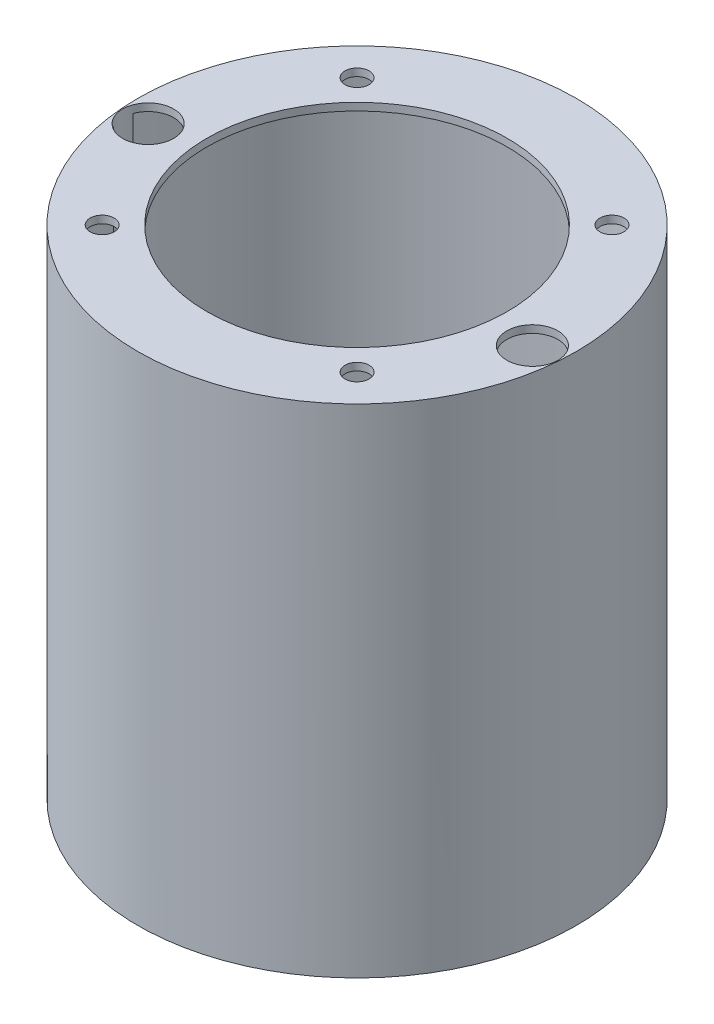
ISO-10303-21;
HEADER;
FILE_DESCRIPTION(('STEP AP214'),'2;1');
FILE_NAME('part.step','',(''),(''),'','','');
FILE_SCHEMA(('AUTOMOTIVE_DESIGN { 1 0 10303 214 1 1 1 1 }'));
ENDSEC;
DATA;
#1=APPLICATION_CONTEXT('core data for automotive mechanical design processes');
#2=APPLICATION_PROTOCOL_DEFINITION('international standard','automotive_design',2000,#1);
#3=PRODUCT_CONTEXT('',#1,'mechanical');
#4=PRODUCT('Part','Part','',(#3));
#5=PRODUCT_RELATED_PRODUCT_CATEGORY('part','',(#4));
#6=PRODUCT_DEFINITION_FORMATION('','',#4);
#7=PRODUCT_DEFINITION_CONTEXT('part definition',#1,'design');
#8=PRODUCT_DEFINITION('design','',#6,#7);
#9=PRODUCT_DEFINITION_SHAPE('','',#8);
#10=(LENGTH_UNIT() NAMED_UNIT(*) SI_UNIT(.MILLI.,.METRE.));
#11=(NAMED_UNIT(*) PLANE_ANGLE_UNIT() SI_UNIT($,.RADIAN.));
#12=(NAMED_UNIT(*) SI_UNIT($,.STERADIAN.) SOLID_ANGLE_UNIT());
#13=UNCERTAINTY_MEASURE_WITH_UNIT(LENGTH_MEASURE(1.E-05),#10,'distance_accuracy_value','');
#14=(GEOMETRIC_REPRESENTATION_CONTEXT(3) GLOBAL_UNCERTAINTY_ASSIGNED_CONTEXT((#13)) GLOBAL_UNIT_ASSIGNED_CONTEXT((#10,
#11,#12)) REPRESENTATION_CONTEXT('',''));
#15=CARTESIAN_POINT('',(0.,0.,0.));
#16=DIRECTION('',(0.,0.,1.));
#17=DIRECTION('',(1.,0.,0.));
#18=AXIS2_PLACEMENT_3D('',#15,#16,#17);
#19=CARTESIAN_POINT('',(0.,-207.01,0.));
#20=DIRECTION('',(0.,1.,0.));
#21=DIRECTION('',(0.,0.,1.));
#22=AXIS2_PLACEMENT_3D('',#19,#20,#21);
#23=CYLINDRICAL_SURFACE('',#22,91.44);
#24=CARTESIAN_POINT('',(0.,-207.01,0.));
#25=DIRECTION('',(0.,-1.,0.));
#26=DIRECTION('',(0.,0.,-1.));
#27=AXIS2_PLACEMENT_3D('',#24,#25,#26);
#28=CIRCLE('',#27,91.44);
#29=CARTESIAN_POINT('',(90.5837880600415,-207.01,12.4840274228105));
#30=VERTEX_POINT('',#29);
#31=CARTESIAN_POINT('',(-90.5837880600415,-207.01,12.4840274228104));
#32=VERTEX_POINT('',#31);
#33=EDGE_CURVE('E86',#30,#32,#28,.T.);
#34=ORIENTED_EDGE('',*,*,#33,.T.);
#35=DIRECTION('',(0.,1.,0.));
#36=VECTOR('',#35,1.);
#37=CARTESIAN_POINT('',(-90.5837880600414,-101.9175,12.4840274228105));
#38=LINE('',#37,#36);
#39=CARTESIAN_POINT('',(-90.5837880600415,0.,12.4840274228106));
#40=VERTEX_POINT('',#39);
#41=EDGE_CURVE('E11',#32,#40,#38,.T.);
#42=ORIENTED_EDGE('',*,*,#41,.T.);
#43=CARTESIAN_POINT('',(0.,0.,0.));
#44=DIRECTION('',(0.,-1.,0.));
#45=DIRECTION('',(0.,0.,-1.));
#46=AXIS2_PLACEMENT_3D('',#43,#44,#45);
#47=CIRCLE('',#46,91.44);
#48=CARTESIAN_POINT('',(90.5837880600415,0.,12.4840274228105));
#49=VERTEX_POINT('',#48);
#50=EDGE_CURVE('E96',#49,#40,#47,.T.);
#51=ORIENTED_EDGE('',*,*,#50,.F.);
#52=DIRECTION('',(0.,1.,0.));
#53=VECTOR('',#52,1.);
#54=CARTESIAN_POINT('',(90.5837880600414,-101.9175,12.4840274228105));
#55=LINE('',#54,#53);
#56=EDGE_CURVE('E90',#30,#49,#55,.T.);
#57=ORIENTED_EDGE('',*,*,#56,.F.);
#58=EDGE_LOOP('',(#34,#42,#51,#57));
#59=FACE_BOUND('',#58,.T.);
#60=ADVANCED_FACE('F35',(#59),#23,.F.);
#61=CARTESIAN_POINT('',(-91.3754453906586,0.,3.43534272799283));
#62=VERTEX_POINT('',#61);
#63=CARTESIAN_POINT('',(91.3754453906586,0.,3.43534272799283));
#64=VERTEX_POINT('',#63);
#65=EDGE_CURVE('E101',#62,#64,#47,.T.);
#66=ORIENTED_EDGE('',*,*,#65,.F.);
#67=DIRECTION('',(0.,1.,0.));
#68=VECTOR('',#67,1.);
#69=CARTESIAN_POINT('',(-91.3754453906585,-101.9175,3.43534272799285));
#70=LINE('',#69,#68);
#71=CARTESIAN_POINT('',(-91.3754453906586,-207.01,3.43534272799301));
#72=VERTEX_POINT('',#71);
#73=EDGE_CURVE('E43',#62,#72,#70,.F.);
#74=ORIENTED_EDGE('',*,*,#73,.T.);
#75=CARTESIAN_POINT('',(91.3754453906585,-207.01,3.43534272799287));
#76=VERTEX_POINT('',#75);
#77=EDGE_CURVE('E87',#72,#76,#28,.T.);
#78=ORIENTED_EDGE('',*,*,#77,.T.);
#79=DIRECTION('',(0.,1.,0.));
#80=VECTOR('',#79,1.);
#81=CARTESIAN_POINT('',(91.3754453906585,-101.9175,3.43534272799285));
#82=LINE('',#81,#80);
#83=EDGE_CURVE('E112',#64,#76,#82,.F.);
#84=ORIENTED_EDGE('',*,*,#83,.F.);
#85=EDGE_LOOP('',(#66,#74,#78,#84));
#86=FACE_BOUND('',#85,.T.);
#87=ADVANCED_FACE('F115',(#86),#23,.F.);
#88=CARTESIAN_POINT('',(0.,0.,0.));
#89=DIRECTION('',(0.,1.,0.));
#90=DIRECTION('',(0.,0.,1.));
#91=AXIS2_PLACEMENT_3D('',#88,#89,#90);
#92=PLANE('',#91);
#93=CARTESIAN_POINT('',(53.8815367264146,0.,-53.8815367264152));
#94=DIRECTION('',(0.,1.,0.));
#95=DIRECTION('',(0.,0.,1.));
#96=AXIS2_PLACEMENT_3D('',#93,#94,#95);
#97=CIRCLE('',#96,5.08000000000001);
#98=CARTESIAN_POINT('',(53.8815367264146,0.,-48.8015367264152));
#99=VERTEX_POINT('',#98);
#100=EDGE_CURVE('E262',#99,#99,#97,.F.);
#101=ORIENTED_EDGE('',*,*,#100,.F.);
#102=EDGE_LOOP('',(#101));
#103=FACE_BOUND('',#102,.T.);
#104=CARTESIAN_POINT('',(-53.8815367264152,0.,-53.8815367264146));
#105=DIRECTION('',(0.,1.,0.));
#106=DIRECTION('',(0.,0.,1.));
#107=AXIS2_PLACEMENT_3D('',#104,#105,#106);
#108=CIRCLE('',#107,5.08000000000001);
#109=CARTESIAN_POINT('',(-53.8815367264152,0.,-48.8015367264146));
#110=VERTEX_POINT('',#109);
#111=EDGE_CURVE('E270',#110,#110,#108,.F.);
#112=ORIENTED_EDGE('',*,*,#111,.F.);
#113=EDGE_LOOP('',(#112));
#114=FACE_BOUND('',#113,.T.);
#115=CARTESIAN_POINT('',(-53.8815367264146,0.,53.8815367264152));
#116=DIRECTION('',(0.,1.,0.));
#117=DIRECTION('',(0.,0.,1.));
#118=AXIS2_PLACEMENT_3D('',#115,#116,#117);
#119=CIRCLE('',#118,5.07999999999977);
#120=CARTESIAN_POINT('',(-53.8815367264146,0.,58.961536726415));
#121=VERTEX_POINT('',#120);
#122=EDGE_CURVE('E277',#121,#121,#119,.F.);
#123=ORIENTED_EDGE('',*,*,#122,.F.);
#124=EDGE_LOOP('',(#123));
#125=FACE_BOUND('',#124,.T.);
#126=CARTESIAN_POINT('',(53.8815367264152,0.,53.8815367264146));
#127=DIRECTION('',(0.,1.,0.));
#128=DIRECTION('',(0.,0.,1.));
#129=AXIS2_PLACEMENT_3D('',#126,#127,#128);
#130=CIRCLE('',#129,5.08000000000003);
#131=CARTESIAN_POINT('',(53.8815367264152,0.,58.9615367264147));
#132=VERTEX_POINT('',#131);
#133=EDGE_CURVE('E276',#132,#132,#130,.F.);
#134=ORIENTED_EDGE('',*,*,#133,.F.);
#135=EDGE_LOOP('',(#134));
#136=FACE_BOUND('',#135,.T.);
#137=CARTESIAN_POINT('',(-81.2237385142124,0.,7.10615632918758));
#138=DIRECTION('',(0.,1.,0.));
#139=DIRECTION('',(0.,0.,1.));
#140=AXIS2_PLACEMENT_3D('',#137,#138,#139);
#141=CIRCLE('',#140,10.795);
#142=EDGE_CURVE('E76',#62,#40,#141,.F.);
#143=ORIENTED_EDGE('',*,*,#142,.F.);
#144=ORIENTED_EDGE('',*,*,#65,.T.);
#145=CARTESIAN_POINT('',(81.2237385142124,0.,7.10615632918758));
#146=DIRECTION('',(0.,1.,0.));
#147=DIRECTION('',(0.,0.,1.));
#148=AXIS2_PLACEMENT_3D('',#145,#146,#147);
#149=CIRCLE('',#148,10.795);
#150=EDGE_CURVE('E99',#64,#49,#149,.T.);
#151=ORIENTED_EDGE('',*,*,#150,.T.);
#152=ORIENTED_EDGE('',*,*,#50,.T.);
#153=EDGE_LOOP('',(#143,#144,#151,#152));
#154=FACE_BOUND('',#153,.T.);
#155=CARTESIAN_POINT('',(0.,0.,0.));
#156=DIRECTION('',(0.,1.,0.));
#157=DIRECTION('',(0.,0.,1.));
#158=AXIS2_PLACEMENT_3D('',#155,#156,#157);
#159=CIRCLE('',#158,63.5);
#160=CARTESIAN_POINT('',(0.,0.,63.5));
#161=VERTEX_POINT('',#160);
#162=EDGE_CURVE('E94',#161,#161,#159,.T.);
#163=ORIENTED_EDGE('',*,*,#162,.T.);
#164=EDGE_LOOP('',(#163));
#165=FACE_BOUND('',#164,.T.);
#166=ADVANCED_FACE('F118',(#103,#114,#125,#136,#154,#165),#92,.F.);
#167=CARTESIAN_POINT('',(0.,3.175,0.));
#168=DIRECTION('',(0.,1.,0.));
#169=DIRECTION('',(0.,0.,1.));
#170=AXIS2_PLACEMENT_3D('',#167,#168,#169);
#171=PLANE('',#170);
#172=CARTESIAN_POINT('',(53.8815367264146,3.175,-53.8815367264152));
#173=DIRECTION('',(0.,1.,0.));
#174=DIRECTION('',(0.,0.,1.));
#175=AXIS2_PLACEMENT_3D('',#172,#173,#174);
#176=CIRCLE('',#175,5.08000000000001);
#177=CARTESIAN_POINT('',(53.8815367264146,3.175,-48.8015367264152));
#178=VERTEX_POINT('',#177);
#179=EDGE_CURVE('E265',#178,#178,#176,.T.);
#180=ORIENTED_EDGE('',*,*,#179,.F.);
#181=EDGE_LOOP('',(#180));
#182=FACE_BOUND('',#181,.T.);
#183=CARTESIAN_POINT('',(-53.8815367264152,3.175,-53.8815367264146));
#184=DIRECTION('',(0.,1.,0.));
#185=DIRECTION('',(0.,0.,1.));
#186=AXIS2_PLACEMENT_3D('',#183,#184,#185);
#187=CIRCLE('',#186,5.08000000000001);
#188=CARTESIAN_POINT('',(-53.8815367264152,3.175,-48.8015367264146));
#189=VERTEX_POINT('',#188);
#190=EDGE_CURVE('E267',#189,#189,#187,.T.);
#191=ORIENTED_EDGE('',*,*,#190,.F.);
#192=EDGE_LOOP('',(#191));
#193=FACE_BOUND('',#192,.T.);
#194=CARTESIAN_POINT('',(-53.8815367264146,3.175,53.8815367264152));
#195=DIRECTION('',(0.,1.,0.));
#196=DIRECTION('',(0.,0.,1.));
#197=AXIS2_PLACEMENT_3D('',#194,#195,#196);
#198=CIRCLE('',#197,5.07999999999977);
#199=CARTESIAN_POINT('',(-53.8815367264146,3.175,58.961536726415));
#200=VERTEX_POINT('',#199);
#201=EDGE_CURVE('E288',#200,#200,#198,.T.);
#202=ORIENTED_EDGE('',*,*,#201,.F.);
#203=EDGE_LOOP('',(#202));
#204=FACE_BOUND('',#203,.T.);
#205=CARTESIAN_POINT('',(53.8815367264152,3.175,53.8815367264146));
#206=DIRECTION('',(0.,1.,0.));
#207=DIRECTION('',(0.,0.,1.));
#208=AXIS2_PLACEMENT_3D('',#205,#206,#207);
#209=CIRCLE('',#208,5.08000000000003);
#210=CARTESIAN_POINT('',(53.8815367264152,3.175,58.9615367264147));
#211=VERTEX_POINT('',#210);
#212=EDGE_CURVE('E273',#211,#211,#209,.T.);
#213=ORIENTED_EDGE('',*,*,#212,.F.);
#214=EDGE_LOOP('',(#213));
#215=FACE_BOUND('',#214,.T.);
#216=CARTESIAN_POINT('',(-81.2237385142124,3.175,7.10615632918758));
#217=DIRECTION('',(0.,-1.,0.));
#218=DIRECTION('',(0.,0.,1.));
#219=AXIS2_PLACEMENT_3D('',#216,#217,#218);
#220=CIRCLE('',#219,10.795);
#221=CARTESIAN_POINT('',(-81.2237385142124,3.175,17.9011563291876));
#222=VERTEX_POINT('',#221);
#223=EDGE_CURVE('E88',#222,#222,#220,.T.);
#224=ORIENTED_EDGE('',*,*,#223,.T.);
#225=EDGE_LOOP('',(#224));
#226=FACE_BOUND('',#225,.T.);
#227=CARTESIAN_POINT('',(81.2237385142124,3.175,7.10615632918758));
#228=DIRECTION('',(0.,1.,0.));
#229=DIRECTION('',(0.,0.,1.));
#230=AXIS2_PLACEMENT_3D('',#227,#228,#229);
#231=CIRCLE('',#230,10.795);
#232=CARTESIAN_POINT('',(81.2237385142124,3.175,17.9011563291876));
#233=VERTEX_POINT('',#232);
#234=EDGE_CURVE('E122',#233,#233,#231,.T.);
#235=ORIENTED_EDGE('',*,*,#234,.F.);
#236=EDGE_LOOP('',(#235));
#237=FACE_BOUND('',#236,.T.);
#238=CARTESIAN_POINT('',(0.,3.175,0.));
#239=DIRECTION('',(0.,1.,0.));
#240=DIRECTION('',(0.,0.,1.));
#241=AXIS2_PLACEMENT_3D('',#238,#239,#240);
#242=CIRCLE('',#241,92.71);
#243=CARTESIAN_POINT('',(0.,3.175,92.71));
#244=VERTEX_POINT('',#243);
#245=EDGE_CURVE('E106',#244,#244,#242,.T.);
#246=ORIENTED_EDGE('',*,*,#245,.T.);
#247=EDGE_LOOP('',(#246));
#248=FACE_BOUND('',#247,.T.);
#249=CARTESIAN_POINT('',(0.,3.175,0.));
#250=DIRECTION('',(0.,1.,0.));
#251=DIRECTION('',(0.,0.,1.));
#252=AXIS2_PLACEMENT_3D('',#249,#250,#251);
#253=CIRCLE('',#252,63.5);
#254=CARTESIAN_POINT('',(0.,3.175,63.5));
#255=VERTEX_POINT('',#254);
#256=EDGE_CURVE('E103',#255,#255,#253,.T.);
#257=ORIENTED_EDGE('',*,*,#256,.F.);
#258=EDGE_LOOP('',(#257));
#259=FACE_BOUND('',#258,.T.);
#260=ADVANCED_FACE('F133',(#182,#193,#204,#215,#226,#237,#248,#259),#171,.T.);
#261=CARTESIAN_POINT('',(0.,3.175,0.));
#262=DIRECTION('',(0.,-1.,0.));
#263=DIRECTION('',(0.,0.,-1.));
#264=AXIS2_PLACEMENT_3D('',#261,#262,#263);
#265=CYLINDRICAL_SURFACE('',#264,92.71);
#266=ORIENTED_EDGE('',*,*,#245,.F.);
#267=EDGE_LOOP('',(#266));
#268=FACE_BOUND('',#267,.T.);
#269=CARTESIAN_POINT('',(0.,-207.01,0.));
#270=DIRECTION('',(0.,-1.,0.));
#271=DIRECTION('',(0.,0.,-1.));
#272=AXIS2_PLACEMENT_3D('',#269,#270,#271);
#273=CIRCLE('',#272,92.71);
#274=CARTESIAN_POINT('',(0.,-207.01,-92.71));
#275=VERTEX_POINT('',#274);
#276=EDGE_CURVE('E91',#275,#275,#273,.T.);
#277=ORIENTED_EDGE('',*,*,#276,.F.);
#278=EDGE_LOOP('',(#277));
#279=FACE_BOUND('',#278,.T.);
#280=ADVANCED_FACE('F37',(#268,#279),#265,.T.);
#281=CARTESIAN_POINT('',(0.,3.175,0.));
#282=DIRECTION('',(0.,-1.,0.));
#283=DIRECTION('',(0.,0.,-1.));
#284=AXIS2_PLACEMENT_3D('',#281,#282,#283);
#285=CYLINDRICAL_SURFACE('',#284,63.5);
#286=ORIENTED_EDGE('',*,*,#256,.T.);
#287=EDGE_LOOP('',(#286));
#288=FACE_BOUND('',#287,.T.);
#289=ORIENTED_EDGE('',*,*,#162,.F.);
#290=EDGE_LOOP('',(#289));
#291=FACE_BOUND('',#290,.T.);
#292=ADVANCED_FACE('F142',(#288,#291),#285,.F.);
#293=CARTESIAN_POINT('',(0.,-207.01,0.));
#294=DIRECTION('',(0.,-1.,0.));
#295=DIRECTION('',(0.,0.,-1.));
#296=AXIS2_PLACEMENT_3D('',#293,#294,#295);
#297=PLANE('',#296);
#298=ORIENTED_EDGE('',*,*,#77,.F.);
#299=CARTESIAN_POINT('',(-81.2237385142124,-207.01,7.10615632918758));
#300=DIRECTION('',(0.,-1.,0.));
#301=DIRECTION('',(0.,0.,-1.));
#302=AXIS2_PLACEMENT_3D('',#299,#300,#301);
#303=CIRCLE('',#302,10.795);
#304=EDGE_CURVE('E50',#32,#72,#303,.T.);
#305=ORIENTED_EDGE('',*,*,#304,.F.);
#306=ORIENTED_EDGE('',*,*,#33,.F.);
#307=CARTESIAN_POINT('',(81.2237385142124,-207.01,7.10615632918758));
#308=DIRECTION('',(0.,-1.,0.));
#309=DIRECTION('',(0.,0.,-1.));
#310=AXIS2_PLACEMENT_3D('',#307,#308,#309);
#311=CIRCLE('',#310,10.795);
#312=EDGE_CURVE('E58',#30,#76,#311,.F.);
#313=ORIENTED_EDGE('',*,*,#312,.T.);
#314=EDGE_LOOP('',(#298,#305,#306,#313));
#315=FACE_BOUND('',#314,.T.);
#316=ORIENTED_EDGE('',*,*,#276,.T.);
#317=EDGE_LOOP('',(#316));
#318=FACE_BOUND('',#317,.T.);
#319=ADVANCED_FACE('F84',(#315,#318),#297,.T.);
#320=CARTESIAN_POINT('',(81.2237385142124,-237.542870811635,7.10615632918758));
#321=DIRECTION('',(0.,1.,0.));
#322=DIRECTION('',(0.,0.,1.));
#323=AXIS2_PLACEMENT_3D('',#320,#321,#322);
#324=CYLINDRICAL_SURFACE('',#323,10.795);
#325=ORIENTED_EDGE('',*,*,#83,.T.);
#326=ORIENTED_EDGE('',*,*,#312,.F.);
#327=ORIENTED_EDGE('',*,*,#56,.T.);
#328=ORIENTED_EDGE('',*,*,#150,.F.);
#329=EDGE_LOOP('',(#325,#326,#327,#328));
#330=FACE_BOUND('',#329,.T.);
#331=ORIENTED_EDGE('',*,*,#234,.T.);
#332=EDGE_LOOP('',(#331));
#333=FACE_BOUND('',#332,.T.);
#334=ADVANCED_FACE('F127',(#330,#333),#324,.F.);
#335=CARTESIAN_POINT('',(-81.2237385142124,-237.542870811635,7.10615632918758));
#336=DIRECTION('',(0.,1.,0.));
#337=DIRECTION('',(0.,0.,1.));
#338=AXIS2_PLACEMENT_3D('',#335,#336,#337);
#339=CYLINDRICAL_SURFACE('',#338,10.795);
#340=ORIENTED_EDGE('',*,*,#223,.F.);
#341=EDGE_LOOP('',(#340));
#342=FACE_BOUND('',#341,.T.);
#343=ORIENTED_EDGE('',*,*,#304,.T.);
#344=ORIENTED_EDGE('',*,*,#73,.F.);
#345=ORIENTED_EDGE('',*,*,#142,.T.);
#346=ORIENTED_EDGE('',*,*,#41,.F.);
#347=EDGE_LOOP('',(#343,#344,#345,#346));
#348=FACE_BOUND('',#347,.T.);
#349=ADVANCED_FACE('F74',(#342,#348),#339,.F.);
#350=CARTESIAN_POINT('',(53.8815367264152,-14.3684097937107,53.8815367264146));
#351=DIRECTION('',(0.,1.,0.));
#352=DIRECTION('',(0.,0.,1.));
#353=AXIS2_PLACEMENT_3D('',#350,#351,#352);
#354=CYLINDRICAL_SURFACE('',#353,5.08000000000003);
#355=ORIENTED_EDGE('',*,*,#133,.T.);
#356=EDGE_LOOP('',(#355));
#357=FACE_BOUND('',#356,.T.);
#358=ORIENTED_EDGE('',*,*,#212,.T.);
#359=EDGE_LOOP('',(#358));
#360=FACE_BOUND('',#359,.T.);
#361=ADVANCED_FACE('F178',(#357,#360),#354,.F.);
#362=CARTESIAN_POINT('',(-53.8815367264146,-14.3684097937107,53.8815367264152));
#363=DIRECTION('',(0.,1.,0.));
#364=DIRECTION('',(0.,0.,1.));
#365=AXIS2_PLACEMENT_3D('',#362,#363,#364);
#366=CYLINDRICAL_SURFACE('',#365,5.07999999999977);
#367=ORIENTED_EDGE('',*,*,#122,.T.);
#368=EDGE_LOOP('',(#367));
#369=FACE_BOUND('',#368,.T.);
#370=ORIENTED_EDGE('',*,*,#201,.T.);
#371=EDGE_LOOP('',(#370));
#372=FACE_BOUND('',#371,.T.);
#373=ADVANCED_FACE('F185',(#369,#372),#366,.F.);
#374=CARTESIAN_POINT('',(-53.8815367264152,-14.3684097937107,-53.8815367264146));
#375=DIRECTION('',(0.,1.,0.));
#376=DIRECTION('',(0.,0.,1.));
#377=AXIS2_PLACEMENT_3D('',#374,#375,#376);
#378=CYLINDRICAL_SURFACE('',#377,5.08000000000001);
#379=ORIENTED_EDGE('',*,*,#111,.T.);
#380=EDGE_LOOP('',(#379));
#381=FACE_BOUND('',#380,.T.);
#382=ORIENTED_EDGE('',*,*,#190,.T.);
#383=EDGE_LOOP('',(#382));
#384=FACE_BOUND('',#383,.T.);
#385=ADVANCED_FACE('F193',(#381,#384),#378,.F.);
#386=CARTESIAN_POINT('',(53.8815367264146,-14.3684097937107,-53.8815367264152));
#387=DIRECTION('',(0.,1.,0.));
#388=DIRECTION('',(0.,0.,1.));
#389=AXIS2_PLACEMENT_3D('',#386,#387,#388);
#390=CYLINDRICAL_SURFACE('',#389,5.08000000000001);
#391=ORIENTED_EDGE('',*,*,#100,.T.);
#392=EDGE_LOOP('',(#391));
#393=FACE_BOUND('',#392,.T.);
#394=ORIENTED_EDGE('',*,*,#179,.T.);
#395=EDGE_LOOP('',(#394));
#396=FACE_BOUND('',#395,.T.);
#397=ADVANCED_FACE('F201',(#393,#396),#390,.F.);
#398=CLOSED_SHELL('',(#60,#87,#166,#260,#280,#292,#319,#334,#349,#361,#373,#385,#397));
#399=MANIFOLD_SOLID_BREP('B2',#398);
#400=ADVANCED_BREP_SHAPE_REPRESENTATION('',(#18,#399),#14);
#401=SHAPE_DEFINITION_REPRESENTATION(#9,#400);
ENDSEC;
END-ISO-10303-21;
